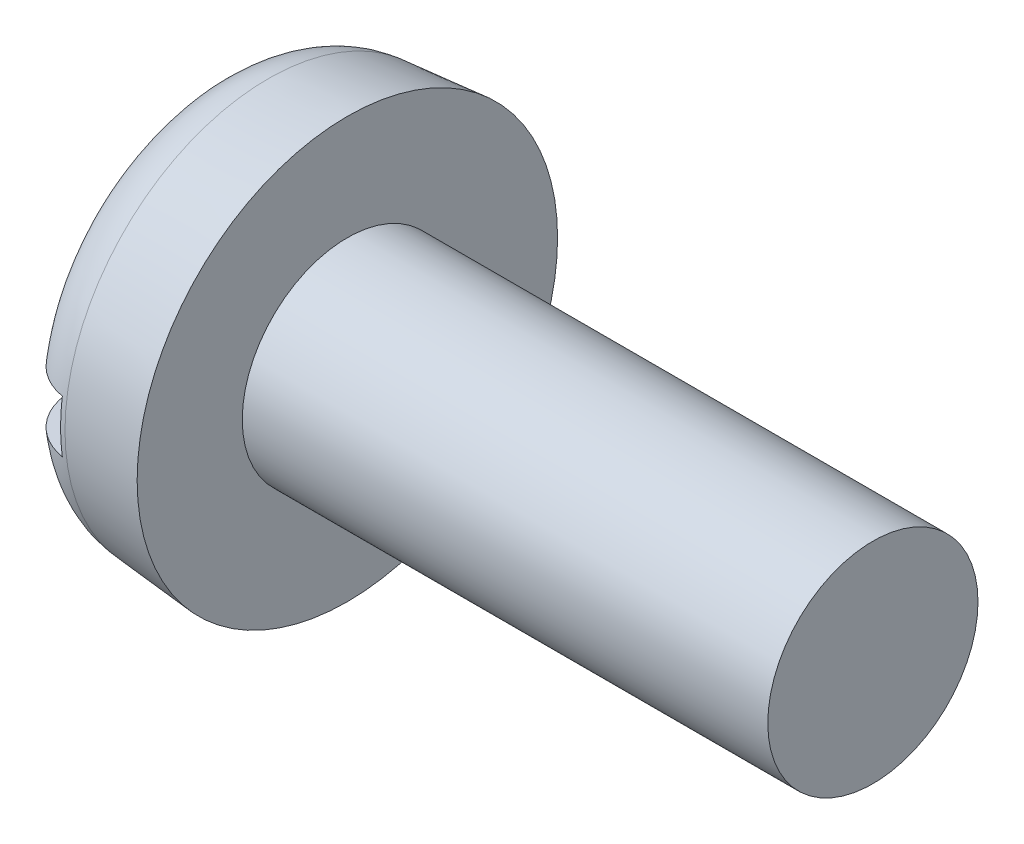
ISO-10303-21;
HEADER;
FILE_DESCRIPTION(('STEP AP214'),'2;1');
FILE_NAME('part.step','',(''),(''),'','','');
FILE_SCHEMA(('AUTOMOTIVE_DESIGN { 1 0 10303 214 1 1 1 1 }'));
ENDSEC;
DATA;
#1=APPLICATION_CONTEXT('core data for automotive mechanical design processes');
#2=APPLICATION_PROTOCOL_DEFINITION('international standard','automotive_design',2000,#1);
#3=PRODUCT_CONTEXT('',#1,'mechanical');
#4=PRODUCT('Part','Part','',(#3));
#5=PRODUCT_RELATED_PRODUCT_CATEGORY('part','',(#4));
#6=PRODUCT_DEFINITION_FORMATION('','',#4);
#7=PRODUCT_DEFINITION_CONTEXT('part definition',#1,'design');
#8=PRODUCT_DEFINITION('design','',#6,#7);
#9=PRODUCT_DEFINITION_SHAPE('','',#8);
#10=(LENGTH_UNIT() NAMED_UNIT(*) SI_UNIT(.MILLI.,.METRE.));
#11=(NAMED_UNIT(*) PLANE_ANGLE_UNIT() SI_UNIT($,.RADIAN.));
#12=(NAMED_UNIT(*) SI_UNIT($,.STERADIAN.) SOLID_ANGLE_UNIT());
#13=UNCERTAINTY_MEASURE_WITH_UNIT(LENGTH_MEASURE(1.E-05),#10,'distance_accuracy_value','');
#14=(GEOMETRIC_REPRESENTATION_CONTEXT(3) GLOBAL_UNCERTAINTY_ASSIGNED_CONTEXT((#13)) GLOBAL_UNIT_ASSIGNED_CONTEXT((#10,
#11,#12)) REPRESENTATION_CONTEXT('',''));
#15=CARTESIAN_POINT('',(0.,0.,0.));
#16=DIRECTION('',(0.,0.,1.));
#17=DIRECTION('',(1.,0.,0.));
#18=AXIS2_PLACEMENT_3D('',#15,#16,#17);
#19=CARTESIAN_POINT('',(0.,0.,0.));
#20=DIRECTION('',(-1.,0.,0.));
#21=DIRECTION('',(0.,0.,1.));
#22=AXIS2_PLACEMENT_3D('',#19,#20,#21);
#23=PLANE('',#22);
#24=DIRECTION('',(0.,0.,-1.));
#25=VECTOR('',#24,1.);
#26=CARTESIAN_POINT('',(0.,0.249999999999998,2.));
#27=LINE('',#26,#25);
#28=CARTESIAN_POINT('',(0.,0.249999999999998,1.3128752634498));
#29=VERTEX_POINT('',#28);
#30=CARTESIAN_POINT('',(0.,0.249999999999998,-1.3128752634498));
#31=VERTEX_POINT('',#30);
#32=EDGE_CURVE('E85',#29,#31,#27,.T.);
#33=ORIENTED_EDGE('',*,*,#32,.F.);
#34=CARTESIAN_POINT('',(0.,0.,0.));
#35=DIRECTION('',(-1.,0.,0.));
#36=DIRECTION('',(0.,0.,1.));
#37=AXIS2_PLACEMENT_3D('',#34,#35,#36);
#38=CIRCLE('',#37,1.33646603300584);
#39=EDGE_CURVE('E91',#29,#31,#38,.T.);
#40=ORIENTED_EDGE('',*,*,#39,.T.);
#41=EDGE_LOOP('',(#33,#40));
#42=FACE_BOUND('',#41,.T.);
#43=ADVANCED_FACE('F32',(#42),#23,.T.);
#44=CARTESIAN_POINT('',(-25.4,0.,0.));
#45=DIRECTION('',(-1.,0.,0.));
#46=DIRECTION('',(0.,0.,1.));
#47=AXIS2_PLACEMENT_3D('',#44,#45,#46);
#48=CYLINDRICAL_SURFACE('',#47,1.);
#49=CARTESIAN_POINT('',(6.3,0.,0.));
#50=DIRECTION('',(-1.,0.,0.));
#51=DIRECTION('',(0.,0.,1.));
#52=AXIS2_PLACEMENT_3D('',#49,#50,#51);
#53=CIRCLE('',#52,1.);
#54=CARTESIAN_POINT('',(6.3,0.,1.));
#55=VERTEX_POINT('',#54);
#56=EDGE_CURVE('E92',#55,#55,#53,.T.);
#57=ORIENTED_EDGE('',*,*,#56,.T.);
#58=EDGE_LOOP('',(#57));
#59=FACE_BOUND('',#58,.T.);
#60=CARTESIAN_POINT('',(1.3,0.,0.));
#61=DIRECTION('',(-1.,0.,0.));
#62=DIRECTION('',(0.,0.,1.));
#63=AXIS2_PLACEMENT_3D('',#60,#61,#62);
#64=CIRCLE('',#63,1.);
#65=CARTESIAN_POINT('',(1.3,0.,1.));
#66=VERTEX_POINT('',#65);
#67=EDGE_CURVE('E149',#66,#66,#64,.T.);
#68=ORIENTED_EDGE('',*,*,#67,.F.);
#69=EDGE_LOOP('',(#68));
#70=FACE_BOUND('',#69,.T.);
#71=ADVANCED_FACE('F137',(#59,#70),#48,.T.);
#72=CARTESIAN_POINT('',(6.3,1.,0.));
#73=DIRECTION('',(1.,0.,0.));
#74=DIRECTION('',(0.,0.,-1.));
#75=AXIS2_PLACEMENT_3D('',#72,#73,#74);
#76=PLANE('',#75);
#77=ORIENTED_EDGE('',*,*,#56,.F.);
#78=EDGE_LOOP('',(#77));
#79=FACE_BOUND('',#78,.T.);
#80=ADVANCED_FACE('F135',(#79),#76,.T.);
#81=DIRECTION('',(0.,0.,1.));
#82=VECTOR('',#81,1.);
#83=CARTESIAN_POINT('',(0.,-0.25,-2.));
#84=LINE('',#83,#82);
#85=CARTESIAN_POINT('',(0.,-0.25,-1.3128752634498));
#86=VERTEX_POINT('',#85);
#87=CARTESIAN_POINT('',(0.,-0.25,1.3128752634498));
#88=VERTEX_POINT('',#87);
#89=EDGE_CURVE('E76',#86,#88,#84,.T.);
#90=ORIENTED_EDGE('',*,*,#89,.F.);
#91=EDGE_CURVE('E83',#86,#88,#38,.T.);
#92=ORIENTED_EDGE('',*,*,#91,.T.);
#93=EDGE_LOOP('',(#90,#92));
#94=FACE_BOUND('',#93,.T.);
#95=ADVANCED_FACE('F82',(#94),#23,.T.);
#96=CARTESIAN_POINT('',(0.,0.,0.));
#97=DIRECTION('',(1.,0.,0.));
#98=DIRECTION('',(0.,0.,-1.));
#99=AXIS2_PLACEMENT_3D('',#96,#97,#98);
#100=CONICAL_SURFACE('',#99,1.8862647374163,0.0872664625997168);
#101=CARTESIAN_POINT('',(0.547706554351407,0.,0.));
#102=DIRECTION('',(-1.,0.,0.));
#103=DIRECTION('',(0.,0.,1.));
#104=AXIS2_PLACEMENT_3D('',#101,#102,#103);
#105=CIRCLE('',#104,1.93418285186089);
#106=CARTESIAN_POINT('',(0.547706554351407,0.,1.93418285186089));
#107=VERTEX_POINT('',#106);
#108=EDGE_CURVE('E95',#107,#107,#105,.F.);
#109=ORIENTED_EDGE('',*,*,#108,.T.);
#110=EDGE_LOOP('',(#109));
#111=FACE_BOUND('',#110,.T.);
#112=CARTESIAN_POINT('',(1.3,0.,0.));
#113=DIRECTION('',(-1.,0.,0.));
#114=DIRECTION('',(0.,0.,1.));
#115=AXIS2_PLACEMENT_3D('',#112,#113,#114);
#116=CIRCLE('',#115,2.);
#117=CARTESIAN_POINT('',(1.3,0.,2.));
#118=VERTEX_POINT('',#117);
#119=EDGE_CURVE('E97',#118,#118,#116,.T.);
#120=ORIENTED_EDGE('',*,*,#119,.T.);
#121=EDGE_LOOP('',(#120));
#122=FACE_BOUND('',#121,.T.);
#123=ADVANCED_FACE('F128',(#111,#122),#100,.T.);
#124=CARTESIAN_POINT('',(1.3,1.,0.));
#125=DIRECTION('',(-1.,0.,0.));
#126=DIRECTION('',(0.,0.,1.));
#127=AXIS2_PLACEMENT_3D('',#124,#125,#126);
#128=PLANE('',#127);
#129=ORIENTED_EDGE('',*,*,#119,.F.);
#130=EDGE_LOOP('',(#129));
#131=FACE_BOUND('',#130,.T.);
#132=ORIENTED_EDGE('',*,*,#67,.T.);
#133=EDGE_LOOP('',(#132));
#134=FACE_BOUND('',#133,.T.);
#135=ADVANCED_FACE('F124',(#131,#134),#128,.F.);
#136=CARTESIAN_POINT('',(0.6,0.,0.));
#137=DIRECTION('',(-1.,0.,0.));
#138=DIRECTION('',(0.,0.,1.));
#139=AXIS2_PLACEMENT_3D('',#136,#137,#138);
#140=TOROIDAL_SURFACE('',#139,1.33646603300584,0.6);
#141=CARTESIAN_POINT('',(0.189533827817901,0.249999999999998,-1.75639022379603));
#142=CARTESIAN_POINT('',(0.21391286216601,0.249999999999998,-1.77948467879215));
#143=CARTESIAN_POINT('',(0.24024869251996,0.249999999999998,-1.80054732602975));
#144=CARTESIAN_POINT('',(0.29610074391237,0.249999999999998,-1.83797474829039));
#145=CARTESIAN_POINT('',(0.325620462292747,0.249999999999998,-1.8543342833978));
#146=CARTESIAN_POINT('',(0.386987812296968,0.249999999999998,-1.88185217452822));
#147=CARTESIAN_POINT('',(0.418834909980418,0.249999999999998,-1.89301171921107));
#148=CARTESIAN_POINT('',(0.483946745898609,0.249999999999998,-1.90980045672232));
#149=CARTESIAN_POINT('',(0.517211148144342,0.249999999999998,-1.91543095275046));
#150=CARTESIAN_POINT('',(0.584095524353838,0.249999999999998,-1.9209904940799));
#151=CARTESIAN_POINT('',(0.617713844349067,0.249999999999998,-1.92093944452031));
#152=CARTESIAN_POINT('',(0.68446419730632,0.249999999999998,-1.91518683561912));
#153=CARTESIAN_POINT('',(0.717596219865291,0.249999999999998,-1.9094851555754));
#154=CARTESIAN_POINT('',(0.782394728177749,0.249999999999998,-1.89260855523632));
#155=CARTESIAN_POINT('',(0.814062838786521,0.249999999999998,-1.88143987080057));
#156=CARTESIAN_POINT('',(0.875081719042154,0.249999999999998,-1.85395886056325));
#157=CARTESIAN_POINT('',(0.904432479739422,0.249999999999998,-1.83764651489811));
#158=CARTESIAN_POINT('',(0.960077668170309,0.249999999999998,-1.80029907430071));
#159=CARTESIAN_POINT('',(0.9863631939778,0.249999999999998,-1.77925071957873));
#160=CARTESIAN_POINT('',(1.03505687827878,0.249999999999998,-1.7330674010218));
#161=CARTESIAN_POINT('',(1.05746494761213,0.249999999999998,-1.70793234324094));
#162=CARTESIAN_POINT('',(1.0979409615539,0.249999999999998,-1.65410838092135));
#163=CARTESIAN_POINT('',(1.11597775303151,0.249999999999998,-1.62539605538755));
#164=CARTESIAN_POINT('',(1.14703544330799,0.249999999999998,-1.5653772191606));
#165=CARTESIAN_POINT('',(1.16005610755277,0.249999999999998,-1.53407058724083));
#166=CARTESIAN_POINT('',(1.18087595689125,0.249999999999998,-1.46937944263898));
#167=CARTESIAN_POINT('',(1.18861493327469,0.249999999999998,-1.43597556112735));
#168=CARTESIAN_POINT('',(1.19846481064019,0.249999999999998,-1.36834921922207));
#169=CARTESIAN_POINT('',(1.20057530995114,0.249999999999998,-1.33412670058295));
#170=CARTESIAN_POINT('',(1.19914590702781,0.249999999999998,-1.26528435330154));
#171=CARTESIAN_POINT('',(1.19552039050567,0.249999999999998,-1.23066630746069));
#172=CARTESIAN_POINT('',(1.18260355578657,0.249999999999998,-1.16250404029349));
#173=CARTESIAN_POINT('',(1.17331170222089,0.249999999999998,-1.12895992074944));
#174=CARTESIAN_POINT('',(1.14915573466833,0.249999999999998,-1.06333384303725));
#175=CARTESIAN_POINT('',(1.13420536362349,0.249999999999998,-1.03128361697005));
#176=CARTESIAN_POINT('',(1.0991747716444,0.249999999999998,-0.970116514628923));
#177=CARTESIAN_POINT('',(1.07909393133358,0.249999999999998,-0.940999993119051));
#178=CARTESIAN_POINT('',(1.03417877153461,0.249999999999998,-0.886344344337588));
#179=CARTESIAN_POINT('',(1.00931177521377,0.249999999999998,-0.860832030218337));
#180=CARTESIAN_POINT('',(0.955570488268512,0.249999999999998,-0.814438910149995));
#181=CARTESIAN_POINT('',(0.92669634225853,0.249999999999998,-0.793557937130591));
#182=CARTESIAN_POINT('',(0.866335805754991,0.249999999999998,-0.757555528040479));
#183=CARTESIAN_POINT('',(0.83491365092188,0.249999999999998,-0.742326677823585));
#184=CARTESIAN_POINT('',(0.769865902721808,0.249999999999998,-0.717693489873345));
#185=CARTESIAN_POINT('',(0.736241371619699,0.249999999999998,-0.708286366711637));
#186=CARTESIAN_POINT('',(0.669621905407705,0.249999999999998,-0.696081257465448));
#187=CARTESIAN_POINT('',(0.636685211338539,0.249999999999998,-0.692964916694868));
#188=CARTESIAN_POINT('',(0.570777199013914,0.249999999999998,-0.692530383395183));
#189=CARTESIAN_POINT('',(0.537805889450138,0.249999999999998,-0.695210977210711));
#190=CARTESIAN_POINT('',(0.473961957121503,0.249999999999998,-0.706041612382887));
#191=CARTESIAN_POINT('',(0.443056210602368,0.249999999999998,-0.713998628670388));
#192=CARTESIAN_POINT('',(0.382959959875471,0.249999999999998,-0.734849180251284));
#193=CARTESIAN_POINT('',(0.353769727200809,0.249999999999998,-0.747743494610361));
#194=CARTESIAN_POINT('',(0.297037609586116,0.249999999999998,-0.778418213510759));
#195=CARTESIAN_POINT('',(0.269563513959213,0.249999999999998,-0.796323727261397));
#196=CARTESIAN_POINT('',(0.217810745198938,0.249999999999998,-0.836272273872065));
#197=CARTESIAN_POINT('',(0.193532799616091,0.249999999999998,-0.858316246022494));
#198=CARTESIAN_POINT('',(0.147530412376912,0.249999999999998,-0.907188078087667));
#199=CARTESIAN_POINT('',(0.126009128611306,0.249999999999998,-0.934207383566724));
#200=CARTESIAN_POINT('',(0.0876544687450438,0.249999999999998,-0.991391836924276));
#201=CARTESIAN_POINT('',(0.0708218617658925,0.249999999999998,-1.02155749981101));
#202=CARTESIAN_POINT('',(0.0418808253678316,0.249999999999998,-1.08512670907524));
#203=CARTESIAN_POINT('',(0.029921236961456,0.249999999999998,-1.11859817427757));
#204=CARTESIAN_POINT('',(0.0117986005132936,0.249999999999998,-1.18707549374775));
#205=CARTESIAN_POINT('',(0.00563542581628784,0.249999999999998,-1.22208131447149));
#206=CARTESIAN_POINT('',(-0.000670915521616435,0.249999999999998,-1.29258202718903));
#207=CARTESIAN_POINT('',(-0.000822867925892758,0.249999999999998,-1.32807612956577));
#208=CARTESIAN_POINT('',(0.00492933169869275,0.249999999999998,-1.39858127024229));
#209=CARTESIAN_POINT('',(0.010834594891854,0.249999999999998,-1.43359221871579));
#210=CARTESIAN_POINT('',(0.0284478524134791,0.249999999999998,-1.50158169418841));
#211=CARTESIAN_POINT('',(0.0400710654600525,0.249999999999998,-1.53458222774722));
#212=CARTESIAN_POINT('',(0.0687763050013223,0.249999999999998,-1.59808423526354));
#213=CARTESIAN_POINT('',(0.0858511560753667,0.249999999999998,-1.62858892830324));
#214=CARTESIAN_POINT('',(0.117592784869628,0.249999999999998,-1.67533700305305));
#215=CARTESIAN_POINT('',(0.130746983226289,0.249999999999998,-1.69262664248886));
#216=CARTESIAN_POINT('',(0.158839636105005,0.249999999999998,-1.72569046888459));
#217=CARTESIAN_POINT('',(0.173778073039715,0.249999999999998,-1.7414646707795));
#218=CARTESIAN_POINT('',(0.189533827817901,0.249999999999998,-1.75639022379603));
#219=B_SPLINE_CURVE_WITH_KNOTS('',3,(#141,#142,#143,#144,#145,#146,#147,#148,#149,#150,#151,
#152,#153,#154,#155,#156,#157,#158,#159,#160,#161,#162,#163,#164,#165,#166,#167,#168,#169,#170,
#171,#172,#173,#174,#175,#176,#177,#178,#179,#180,#181,#182,#183,#184,#185,#186,#187,#188,#189,
#190,#191,#192,#193,#194,#195,#196,#197,#198,#199,#200,#201,#202,#203,#204,#205,#206,#207,#208,
#209,#210,#211,#212,#213,#214,#215,#216,#217,#218),.UNSPECIFIED.,.T.,.F.,(4,2,2,2,2,2,2,2,2,2,2,
2,2,2,2,2,2,2,2,2,2,2,2,2,2,2,2,2,2,2,2,2,2,2,2,2,2,2,4),(0.,0.100664730916281,
0.201441185387835,0.302194592170462,0.40292424561667,0.503301006632521,0.603679911824675,
0.70394458713495,0.804209649647866,0.904759004789331,1.00531067170506,1.10655915996838,
1.20781238203636,1.31020138177896,1.41259768822303,1.51653681009983,1.62048575390889,
1.72608762757818,1.83170225607624,1.9380653163011,2.04442453897639,2.14864413447951,
2.2528138270753,2.35156454182892,2.45029458397876,2.54559856163111,2.64091758368116,
2.738869134693,2.8368429443377,2.94000220563303,3.04317837902267,3.14930468585254,
3.25542867370318,3.36139754921546,3.46738586763706,3.57184799973354,3.6761732021628,
3.74123174488939,3.80628964638302),.UNSPECIFIED.);
#220=CARTESIAN_POINT('',(0.5,0.249999999999998,-1.91179742470572));
#221=VERTEX_POINT('',#220);
#222=EDGE_CURVE('E11',#31,#221,#219,.T.);
#223=ORIENTED_EDGE('',*,*,#222,.F.);
#224=ORIENTED_EDGE('',*,*,#39,.F.);
#225=CARTESIAN_POINT('',(0.288604089174203,0.249999999999998,0.784739016334898));
#226=CARTESIAN_POINT('',(0.316134388457971,0.249999999999998,0.767196914687789));
#227=CARTESIAN_POINT('',(0.345099556161885,0.249999999999998,0.751875311985604));
#228=CARTESIAN_POINT('',(0.405186011024982,0.249999999999998,0.726233960557693));
#229=CARTESIAN_POINT('',(0.436308459251539,0.249999999999998,0.715916929604185));
#230=CARTESIAN_POINT('',(0.499913017867033,0.249999999999998,0.700717140304493));
#231=CARTESIAN_POINT('',(0.532397144208308,0.249999999999998,0.695842757399514));
#232=CARTESIAN_POINT('',(0.597712118075122,0.249999999999998,0.691793299303831));
#233=CARTESIAN_POINT('',(0.630542864477075,0.249999999999998,0.692616605361123));
#234=CARTESIAN_POINT('',(0.694704568383033,0.249999999999998,0.699819560396652));
#235=CARTESIAN_POINT('',(0.726052241959319,0.249999999999998,0.706052028850557));
#236=CARTESIAN_POINT('',(0.787289484038405,0.249999999999998,0.723599538804053));
#237=CARTESIAN_POINT('',(0.817178802983434,0.249999999999998,0.734915446838042));
#238=CARTESIAN_POINT('',(0.875269426551428,0.249999999999998,0.762440714427743));
#239=CARTESIAN_POINT('',(0.903430456569145,0.249999999999998,0.778734824104322));
#240=CARTESIAN_POINT('',(0.956804116043069,0.249999999999998,0.815589498272454));
#241=CARTESIAN_POINT('',(0.982016103087479,0.249999999999998,0.836150989662956));
#242=CARTESIAN_POINT('',(1.0301770633816,0.249999999999998,0.882141005760743));
#243=CARTESIAN_POINT('',(1.05293473503663,0.249999999999998,0.90777002039607));
#244=CARTESIAN_POINT('',(1.09399932055649,0.249999999999998,0.962376268444088));
#245=CARTESIAN_POINT('',(1.11230542100145,0.249999999999998,0.991354112351559));
#246=CARTESIAN_POINT('',(1.14454179886565,0.249999999999998,1.05292268816098));
#247=CARTESIAN_POINT('',(1.1583014153342,0.249999999999998,1.0856029700183));
#248=CARTESIAN_POINT('',(1.18015684562069,0.249999999999998,1.15280722636384));
#249=CARTESIAN_POINT('',(1.18825243720312,0.249999999999998,1.18733127313742));
#250=CARTESIAN_POINT('',(1.19852509118479,0.249999999999998,1.25734425726337));
#251=CARTESIAN_POINT('',(1.20068664617312,0.249999999999998,1.29283547844414));
#252=CARTESIAN_POINT('',(1.19893284924428,0.249999999999998,1.36366876527333));
#253=CARTESIAN_POINT('',(1.19501786044981,0.249999999999998,1.39901083970791));
#254=CARTESIAN_POINT('',(1.18127073741266,0.249999999999998,1.46802046326244));
#255=CARTESIAN_POINT('',(1.17152068295649,0.249999999999998,1.50170435277859));
#256=CARTESIAN_POINT('',(1.14641062930972,0.249999999999998,1.56691275558684));
#257=CARTESIAN_POINT('',(1.13105111093402,0.249999999999998,1.59843745367896));
#258=CARTESIAN_POINT('',(1.09543149628465,0.249999999999998,1.65788896257222));
#259=CARTESIAN_POINT('',(1.07525501841527,0.249999999999998,1.68586588029872));
#260=CARTESIAN_POINT('',(1.03043421840679,0.249999999999998,1.7379775228163));
#261=CARTESIAN_POINT('',(1.00579022553272,0.249999999999998,1.76211253051798));
#262=CARTESIAN_POINT('',(0.953084078701208,0.249999999999998,1.80552791413681));
#263=CARTESIAN_POINT('',(0.925070615500831,0.249999999999998,1.82486741497749));
#264=CARTESIAN_POINT('',(0.866172088939885,0.249999999999998,1.85852096627687));
#265=CARTESIAN_POINT('',(0.835287172622649,0.249999999999998,1.87283527389001));
#266=CARTESIAN_POINT('',(0.771809247980058,0.249999999999998,1.89591076867881));
#267=CARTESIAN_POINT('',(0.739233180536587,0.249999999999998,1.90471857587887));
#268=CARTESIAN_POINT('',(0.673062365450502,0.249999999999998,1.91671385367368));
#269=CARTESIAN_POINT('',(0.639467647775881,0.249999999999998,1.91990148944717));
#270=CARTESIAN_POINT('',(0.572367006328868,0.249999999999998,1.92056082820682));
#271=CARTESIAN_POINT('',(0.538861320147248,0.249999999999998,1.91805700061079));
#272=CARTESIAN_POINT('',(0.47274681744156,0.249999999999998,1.90745770821608));
#273=CARTESIAN_POINT('',(0.440137992786985,0.249999999999998,1.89936229412536));
#274=CARTESIAN_POINT('',(0.376749063680584,0.249999999999998,1.87782031727239));
#275=CARTESIAN_POINT('',(0.345968470291791,0.249999999999998,1.86437519269455));
#276=CARTESIAN_POINT('',(0.287090397079649,0.249999999999998,1.83252636227956));
#277=CARTESIAN_POINT('',(0.258992940590245,0.249999999999998,1.81412261332498));
#278=CARTESIAN_POINT('',(0.206161899889049,0.249999999999998,1.77281309783707));
#279=CARTESIAN_POINT('',(0.181441147897996,0.249999999999998,1.74989092427143));
#280=CARTESIAN_POINT('',(0.136163127640451,0.249999999999998,1.70025036654744));
#281=CARTESIAN_POINT('',(0.115605984783507,0.249999999999998,1.67353186808351));
#282=CARTESIAN_POINT('',(0.0790587737372173,0.249999999999998,1.61683810625696));
#283=CARTESIAN_POINT('',(0.0631057934141207,0.249999999999998,1.58683894142185));
#284=CARTESIAN_POINT('',(0.0363951291287292,0.249999999999998,1.52461181161474));
#285=CARTESIAN_POINT('',(0.0256377279026837,0.249999999999998,1.49238372545698));
#286=CARTESIAN_POINT('',(0.00947640685416026,0.249999999999998,1.42619753260598));
#287=CARTESIAN_POINT('',(0.00413912422282116,0.249999999999998,1.39222316301904));
#288=CARTESIAN_POINT('',(-0.000849634538205287,0.249999999999998,1.32386185092337));
#289=CARTESIAN_POINT('',(-0.000500896508831784,0.249999999999998,1.28947489292359));
#290=CARTESIAN_POINT('',(0.0058758547136506,0.249999999999998,1.22069241104712));
#291=CARTESIAN_POINT('',(0.0119921296161318,0.249999999999998,1.18630507505805));
#292=CARTESIAN_POINT('',(0.0298241103495643,0.249999999999998,1.11900455274082));
#293=CARTESIAN_POINT('',(0.0415416754422541,0.249999999999998,1.08609185986808));
#294=CARTESIAN_POINT('',(0.0704549929801754,0.249999999999998,1.02214969893802));
#295=CARTESIAN_POINT('',(0.0877332276973655,0.249999999999998,0.991157547202658));
#296=CARTESIAN_POINT('',(0.127221040554368,0.249999999999998,0.932521126786533));
#297=CARTESIAN_POINT('',(0.149425793456868,0.249999999999998,0.904873622883556));
#298=CARTESIAN_POINT('',(0.190938555395152,0.249999999999998,0.861314040022332));
#299=CARTESIAN_POINT('',(0.209157594689925,0.249999999999998,0.844351052347313));
#300=CARTESIAN_POINT('',(0.247508472142762,0.249999999999998,0.812742556461499));
#301=CARTESIAN_POINT('',(0.267640273422716,0.249999999999998,0.798097003584993));
#302=CARTESIAN_POINT('',(0.288604089174203,0.249999999999998,0.784739016334898));
#303=B_SPLINE_CURVE_WITH_KNOTS('',3,(#225,#226,#227,#228,#229,#230,#231,#232,#233,#234,#235,
#236,#237,#238,#239,#240,#241,#242,#243,#244,#245,#246,#247,#248,#249,#250,#251,#252,#253,#254,
#255,#256,#257,#258,#259,#260,#261,#262,#263,#264,#265,#266,#267,#268,#269,#270,#271,#272,#273,
#274,#275,#276,#277,#278,#279,#280,#281,#282,#283,#284,#285,#286,#287,#288,#289,#290,#291,#292,
#293,#294,#295,#296,#297,#298,#299,#300,#301,#302),.UNSPECIFIED.,.T.,.F.,(4,2,2,2,2,2,2,2,2,2,2,
2,2,2,2,2,2,2,2,2,2,2,2,2,2,2,2,2,2,2,2,2,2,2,2,2,2,2,4),(0.,0.0978482535524672,
0.195749585048296,0.29380136566425,0.391825290249414,0.487262796573529,0.582716577563643,
0.679895642124601,0.77709583664887,0.879458297771981,0.981839449194436,1.08771468956162,
1.19359408385085,1.29974991042735,1.40589939357788,1.51058969381323,1.61527102263029,
1.71825267299331,1.82122673648107,1.92285985851661,2.02448777891743,2.12524319524782,
2.22599565029322,2.32631575807894,2.42663495611184,2.52692720312882,2.6272203222596,
2.72788456072493,2.82855183078601,2.93000871197334,3.03147111368232,3.13416636231529,
3.23686547888511,3.34116217015267,3.44549350516041,3.55144984066691,3.65730285269071,
3.73181393153072,3.80632357408619),.UNSPECIFIED.);
#304=CARTESIAN_POINT('',(0.5,0.249999999999998,1.91179742470572));
#305=VERTEX_POINT('',#304);
#306=EDGE_CURVE('E109',#305,#29,#303,.T.);
#307=ORIENTED_EDGE('',*,*,#306,.F.);
#308=CARTESIAN_POINT('',(0.5,0.,0.));
#309=DIRECTION('',(-1.,0.,0.));
#310=DIRECTION('',(0.,0.,1.));
#311=AXIS2_PLACEMENT_3D('',#308,#309,#310);
#312=CIRCLE('',#311,1.92807401131581);
#313=CARTESIAN_POINT('',(0.5,-0.25,1.91179742470572));
#314=VERTEX_POINT('',#313);
#315=EDGE_CURVE('E103',#305,#314,#312,.F.);
#316=ORIENTED_EDGE('',*,*,#315,.T.);
#317=CARTESIAN_POINT('',(0.288604089174203,-0.25,0.784739016334897));
#318=CARTESIAN_POINT('',(0.259112884370909,-0.25,0.803533450988556));
#319=CARTESIAN_POINT('',(0.231225898454724,-0.25,0.824904856053635));
#320=CARTESIAN_POINT('',(0.179420071654655,-0.25,0.87206288075389));
#321=CARTESIAN_POINT('',(0.155508499686268,-0.25,0.897857416808734));
#322=CARTESIAN_POINT('',(0.112340043931651,-0.25,0.953020871097778));
#323=CARTESIAN_POINT('',(0.0930758293141024,-0.25,0.982384048576831));
#324=CARTESIAN_POINT('',(0.0596751161388602,-0.25,1.04387760799463));
#325=CARTESIAN_POINT('',(0.0455365870142384,-0.25,1.07600688787161));
#326=CARTESIAN_POINT('',(0.0226119437209166,-0.25,1.1426440977612));
#327=CARTESIAN_POINT('',(0.0139059243025098,-0.25,1.17717964025791));
#328=CARTESIAN_POINT('',(0.00245830158126969,-0.25,1.24723010379983));
#329=CARTESIAN_POINT('',(-0.000282920324025579,-0.25,1.28274508732485));
#330=CARTESIAN_POINT('',(0.000326978904676154,-0.25,1.35347540033146));
#331=CARTESIAN_POINT('',(0.00363548607635161,-0.25,1.38869108382246));
#332=CARTESIAN_POINT('',(0.0162173169606183,-0.25,1.45804112734748));
#333=CARTESIAN_POINT('',(0.0254901283900699,-0.25,1.49217557998588));
#334=CARTESIAN_POINT('',(0.0495772225171149,-0.25,1.55780848471405));
#335=CARTESIAN_POINT('',(0.0643001953281719,-0.25,1.58934044636737));
#336=CARTESIAN_POINT('',(0.0989096497491142,-0.25,1.64943105983788));
#337=CARTESIAN_POINT('',(0.118795692768763,-0.25,1.67798996392052));
#338=CARTESIAN_POINT('',(0.162837404085459,-0.25,1.73086854568014));
#339=CARTESIAN_POINT('',(0.186923960475927,-0.25,1.75524579767658));
#340=CARTESIAN_POINT('',(0.238887940724712,-0.25,1.79955506100913));
#341=CARTESIAN_POINT('',(0.266765128365121,-0.25,1.81948734913452));
#342=CARTESIAN_POINT('',(0.32518445316871,-0.25,1.85411519160236));
#343=CARTESIAN_POINT('',(0.355693765879882,-0.25,1.86886613843065));
#344=CARTESIAN_POINT('',(0.418767055309767,-0.25,1.89299762786523));
#345=CARTESIAN_POINT('',(0.451330946358749,-0.25,1.90237839422782));
#346=CARTESIAN_POINT('',(0.517357480403314,-0.25,1.91544694524538));
#347=CARTESIAN_POINT('',(0.550812766202489,-0.25,1.91917192408416));
#348=CARTESIAN_POINT('',(0.617872702410234,-0.25,1.9209371349684));
#349=CARTESIAN_POINT('',(0.65147734983796,-0.25,1.91897747995936));
#350=CARTESIAN_POINT('',(0.717795709520632,-0.25,1.90944321159363));
#351=CARTESIAN_POINT('',(0.750511403187723,-0.25,1.90188236922565));
#352=CARTESIAN_POINT('',(0.814211773464019,-0.25,1.88138343728574));
#353=CARTESIAN_POINT('',(0.845196451653629,-0.25,1.8684453526233));
#354=CARTESIAN_POINT('',(0.904609763053002,-0.25,1.83754601650854));
#355=CARTESIAN_POINT('',(0.933034452981679,-0.25,1.81957718511303));
#356=CARTESIAN_POINT('',(0.986484508335932,-0.25,1.77914696795246));
#357=CARTESIAN_POINT('',(1.01150981181586,-0.25,1.75668550033834));
#358=CARTESIAN_POINT('',(1.05760565285496,-0.25,1.70778067353059));
#359=CARTESIAN_POINT('',(1.07865349857053,-0.25,1.68131593135762));
#360=CARTESIAN_POINT('',(1.11605706775023,-0.25,1.62525718662348));
#361=CARTESIAN_POINT('',(1.13241261147641,-0.25,1.59566306425126));
#362=CARTESIAN_POINT('',(1.16014645112768,-0.25,1.53387987005179));
#363=CARTESIAN_POINT('',(1.17147446318557,-0.25,1.50166823426566));
#364=CARTESIAN_POINT('',(1.18864316865611,-0.25,1.43581561192305));
#365=CARTESIAN_POINT('',(1.19448351638352,-0.25,1.40217453546109));
#366=CARTESIAN_POINT('',(1.20060402232703,-0.25,1.33391827134408));
#367=CARTESIAN_POINT('',(1.200805568064,-0.25,1.2992960420342));
#368=CARTESIAN_POINT('',(1.19549103445041,-0.25,1.23049390968614));
#369=CARTESIAN_POINT('',(1.18997445818118,-0.25,1.19631404535192));
#370=CARTESIAN_POINT('',(1.17327911206952,-0.25,1.12877552532621));
#371=CARTESIAN_POINT('',(1.16200971687155,-0.25,1.09543926507239));
#372=CARTESIAN_POINT('',(1.1341003010951,-0.25,1.03109391450078));
#373=CARTESIAN_POINT('',(1.11745967090388,-0.25,1.00008508882971));
#374=CARTESIAN_POINT('',(1.07904082648501,-0.25,0.940910551847016));
#375=CARTESIAN_POINT('',(1.0572048260199,-0.25,0.912782315532943));
#376=CARTESIAN_POINT('',(1.00908218884943,-0.25,0.860622014109091));
#377=CARTESIAN_POINT('',(0.982795234064718,-0.25,0.836590241992157));
#378=CARTESIAN_POINT('',(0.926715285698694,-0.25,0.793608894156468));
#379=CARTESIAN_POINT('',(0.896955569067351,-0.25,0.774616000970294));
#380=CARTESIAN_POINT('',(0.834559558231686,-0.25,0.74216152097532));
#381=CARTESIAN_POINT('',(0.801924451047304,-0.25,0.728697664541176));
#382=CARTESIAN_POINT('',(0.73623179128509,-0.25,0.70836577399905));
#383=CARTESIAN_POINT('',(0.703256226316704,-0.25,0.701233231230133));
#384=CARTESIAN_POINT('',(0.636557314490295,-0.25,0.692922965671201));
#385=CARTESIAN_POINT('',(0.602834045644844,-0.25,0.691744624551743));
#386=CARTESIAN_POINT('',(0.537333649207527,-0.25,0.695311592564638));
#387=CARTESIAN_POINT('',(0.505540606673113,-0.25,0.699776178566524));
#388=CARTESIAN_POINT('',(0.443175430624775,-0.25,0.713946111692623));
#389=CARTESIAN_POINT('',(0.412601908129049,-0.25,0.723645302510235));
#390=CARTESIAN_POINT('',(0.366608339343109,-0.25,0.742482025470653));
#391=CARTESIAN_POINT('',(0.350485967304387,-0.25,0.749957763308139));
#392=CARTESIAN_POINT('',(0.31897254209949,-0.25,0.766313857242488));
#393=CARTESIAN_POINT('',(0.30358143570912,-0.25,0.775194110909255));
#394=CARTESIAN_POINT('',(0.288604089174203,-0.25,0.784739016334897));
#395=B_SPLINE_CURVE_WITH_KNOTS('',3,(#317,#318,#319,#320,#321,#322,#323,#324,#325,#326,#327,
#328,#329,#330,#331,#332,#333,#334,#335,#336,#337,#338,#339,#340,#341,#342,#343,#344,#345,#346,
#347,#348,#349,#350,#351,#352,#353,#354,#355,#356,#357,#358,#359,#360,#361,#362,#363,#364,#365,
#366,#367,#368,#369,#370,#371,#372,#373,#374,#375,#376,#377,#378,#379,#380,#381,#382,#383,#384,
#385,#386,#387,#388,#389,#390,#391,#392,#393,#394),.UNSPECIFIED.,.T.,.F.,(4,2,2,2,2,2,2,2,2,2,2,
2,2,2,2,2,2,2,2,2,2,2,2,2,2,2,2,2,2,2,2,2,2,2,2,2,2,2,4),(0.,0.104845289268817,
0.209880225152682,0.314748377364312,0.41957493999829,0.525912610514205,0.632257080210482,
0.737855348956526,0.843444548918052,0.947339393516291,1.05122541538654,1.15354049001198,
1.25584919166555,1.35702822770577,1.45820304766933,1.5587095845989,1.65921412462183,
1.75947238245713,1.85973054875585,1.96014059694996,2.0605524746306,2.16152097514737,
2.26249334273148,2.36445402067816,2.46642112101811,2.56980908185311,2.67320602810594,
2.778284521801,2.883374945662,2.98969391915164,3.09602049374272,3.2014010022258,
3.30673820950848,3.40743359942962,3.50811853216305,3.60398613404926,3.69974123301838,
3.75299164163642,3.80623816853848),.UNSPECIFIED.);
#396=EDGE_CURVE('E90',#88,#314,#395,.T.);
#397=ORIENTED_EDGE('',*,*,#396,.F.);
#398=ORIENTED_EDGE('',*,*,#91,.F.);
#399=CARTESIAN_POINT('',(0.189533827817901,-0.25,-1.75639022379603));
#400=CARTESIAN_POINT('',(0.16481044882289,-0.25,-1.73296530335109));
#401=CARTESIAN_POINT('',(0.142063371887763,-0.25,-1.70741537534206));
#402=CARTESIAN_POINT('',(0.101180421262586,-0.25,-1.65282552401345));
#403=CARTESIAN_POINT('',(0.0830507458652728,-0.25,-1.62378098577046));
#404=CARTESIAN_POINT('',(0.0519283703374219,-0.25,-1.56309520458309));
#405=CARTESIAN_POINT('',(0.0389304222221669,-0.25,-1.53145665462628));
#406=CARTESIAN_POINT('',(0.0183766203038725,-0.25,-1.4664711798565));
#407=CARTESIAN_POINT('',(0.0108194056022057,-0.25,-1.4331246844913));
#408=CARTESIAN_POINT('',(0.00125621976649499,-0.25,-1.36530138011282));
#409=CARTESIAN_POINT('',(-0.000692756882585135,-0.25,-1.33081654414099));
#410=CARTESIAN_POINT('',(0.00112882930904439,-0.25,-1.26199755908225));
#411=CARTESIAN_POINT('',(0.00490010999371502,-0.25,-1.22766342944999));
#412=CARTESIAN_POINT('',(0.0181234965605665,-0.25,-1.15953018446654));
#413=CARTESIAN_POINT('',(0.027666529979709,-0.25,-1.12574871378756));
#414=CARTESIAN_POINT('',(0.0522129128429994,-0.25,-1.0602300598266));
#415=CARTESIAN_POINT('',(0.0672168382122738,-0.25,-1.02849309258091));
#416=CARTESIAN_POINT('',(0.102497114973261,-0.25,-0.96753497895809));
#417=CARTESIAN_POINT('',(0.122840353513864,-0.25,-0.938352506226965));
#418=CARTESIAN_POINT('',(0.16815654765627,-0.25,-0.883826606687018));
#419=CARTESIAN_POINT('',(0.193129935098409,-0.25,-0.858483538369082));
#420=CARTESIAN_POINT('',(0.246930737846179,-0.25,-0.812542923488528));
#421=CARTESIAN_POINT('',(0.27574057593301,-0.25,-0.791924836338685));
#422=CARTESIAN_POINT('',(0.336524528648951,-0.25,-0.756043351278997));
#423=CARTESIAN_POINT('',(0.368497729347565,-0.25,-0.740778412543732));
#424=CARTESIAN_POINT('',(0.433387810729939,-0.25,-0.716739684886528));
#425=CARTESIAN_POINT('',(0.466219411349971,-0.25,-0.70773619775008));
#426=CARTESIAN_POINT('',(0.53295612620906,-0.25,-0.695713195189501));
#427=CARTESIAN_POINT('',(0.566860761003733,-0.25,-0.692691044537604));
#428=CARTESIAN_POINT('',(0.63289155565065,-0.25,-0.692778275171813));
#429=CARTESIAN_POINT('',(0.665018557735387,-0.25,-0.695577120794326));
#430=CARTESIAN_POINT('',(0.728338071633076,-0.25,-0.706552223713997));
#431=CARTESIAN_POINT('',(0.759530549603552,-0.25,-0.71472867550809));
#432=CARTESIAN_POINT('',(0.820042561617088,-0.25,-0.736074380490138));
#433=CARTESIAN_POINT('',(0.849367448658546,-0.25,-0.749228537118214));
#434=CARTESIAN_POINT('',(0.905539095647581,-0.25,-0.780048583669917));
#435=CARTESIAN_POINT('',(0.932385338624187,-0.25,-0.797715411920639));
#436=CARTESIAN_POINT('',(0.984228891872822,-0.25,-0.837971317501609));
#437=CARTESIAN_POINT('',(1.00907272334481,-0.25,-0.860758039337322));
#438=CARTESIAN_POINT('',(1.05478496517247,-0.25,-0.910020684025987));
#439=CARTESIAN_POINT('',(1.0756525292845,-0.25,-0.936497390123483));
#440=CARTESIAN_POINT('',(1.1137297429544,-0.25,-0.993663029409978));
#441=CARTESIAN_POINT('',(1.13073893301591,-0.25,-1.02448573646893));
#442=CARTESIAN_POINT('',(1.15941197685798,-0.25,-1.0885262347756));
#443=CARTESIAN_POINT('',(1.17107537448153,-0.25,-1.12174423013372));
#444=CARTESIAN_POINT('',(1.18880984958103,-0.25,-1.1900562968235));
#445=CARTESIAN_POINT('',(1.19481455289154,-0.25,-1.22516764834155));
#446=CARTESIAN_POINT('',(1.20077760264291,-0.25,-1.29590155947493));
#447=CARTESIAN_POINT('',(1.2007361712324,-0.25,-1.33152410025992));
#448=CARTESIAN_POINT('',(1.19458938784955,-0.25,-1.40186913283581));
#449=CARTESIAN_POINT('',(1.1885472893511,-0.25,-1.43659713700206));
#450=CARTESIAN_POINT('',(1.17061942328439,-0.25,-1.5045114991265));
#451=CARTESIAN_POINT('',(1.15873414917343,-0.25,-1.53769798700705));
#452=CARTESIAN_POINT('',(1.12966988120094,-0.25,-1.6010066198214));
#453=CARTESIAN_POINT('',(1.11258091711957,-0.25,-1.63117009974292));
#454=CARTESIAN_POINT('',(1.07351154080117,-0.25,-1.6881434904905));
#455=CARTESIAN_POINT('',(1.05153150860045,-0.25,-1.71495366161618));
#456=CARTESIAN_POINT('',(1.00364802347861,-0.25,-1.7640566195131));
#457=CARTESIAN_POINT('',(0.977805224263987,-0.25,-1.78640856703207));
#458=CARTESIAN_POINT('',(0.922701604732177,-0.25,-1.82640375787048));
#459=CARTESIAN_POINT('',(0.893440977663865,-0.25,-1.84404726722665));
#460=CARTESIAN_POINT('',(0.832649577244667,-0.25,-1.87394603187197));
#461=CARTESIAN_POINT('',(0.801144412507963,-0.25,-1.88625337199792));
#462=CARTESIAN_POINT('',(0.736509366564556,-0.25,-1.90536973125745));
#463=CARTESIAN_POINT('',(0.703379610465281,-0.25,-1.91217917307309));
#464=CARTESIAN_POINT('',(0.636638536399667,-0.25,-1.92007590165024));
#465=CARTESIAN_POINT('',(0.603031068893571,-0.25,-1.92119577483433));
#466=CARTESIAN_POINT('',(0.53609729420733,-0.25,-1.91776745034433));
#467=CARTESIAN_POINT('',(0.50277105716713,-0.25,-1.9132178784357));
#468=CARTESIAN_POINT('',(0.437394555194039,-0.25,-1.89859274475643));
#469=CARTESIAN_POINT('',(0.405342999289492,-0.25,-1.88852293496507));
#470=CARTESIAN_POINT('',(0.343409576049121,-0.25,-1.86316176818221));
#471=CARTESIAN_POINT('',(0.313525062355737,-0.25,-1.84787691451122));
#472=CARTESIAN_POINT('',(0.26801612097286,-0.25,-1.81956512535395));
#473=CARTESIAN_POINT('',(0.251434931444335,-0.25,-1.80804500382434));
#474=CARTESIAN_POINT('',(0.219515975429254,-0.25,-1.78339518178987));
#475=CARTESIAN_POINT('',(0.204178205095369,-0.25,-1.7702654862656));
#476=CARTESIAN_POINT('',(0.189533827817901,-0.25,-1.75639022379603));
#477=B_SPLINE_CURVE_WITH_KNOTS('',3,(#399,#400,#401,#402,#403,#404,#405,#406,#407,#408,#409,
#410,#411,#412,#413,#414,#415,#416,#417,#418,#419,#420,#421,#422,#423,#424,#425,#426,#427,#428,
#429,#430,#431,#432,#433,#434,#435,#436,#437,#438,#439,#440,#441,#442,#443,#444,#445,#446,#447,
#448,#449,#450,#451,#452,#453,#454,#455,#456,#457,#458,#459,#460,#461,#462,#463,#464,#465,#466,
#467,#468,#469,#470,#471,#472,#473,#474,#475,#476),.UNSPECIFIED.,.T.,.F.,(4,2,2,2,2,2,2,2,2,2,2,
2,2,2,2,2,2,2,2,2,2,2,2,2,2,2,2,2,2,2,2,2,2,2,2,2,2,2,4),(0.,0.102100336324921,
0.204337015848385,0.306468870047131,0.408575168971325,0.511715534232194,0.614868843808299,
0.719691156821885,0.824524527975002,0.930739666196369,1.03696471577847,1.14271882934083,
1.24844247809663,1.35004766418256,1.45160807558232,1.54788965186921,1.64417471065384,
1.74017006316048,1.83618539240744,1.93687160768039,2.03757922748379,2.14270168947607,
2.24783311990947,2.35418288828398,2.46052874912898,2.56576538274798,2.67099313063948,
2.77449484514581,2.87798852036856,2.98000100625893,3.08200772700703,3.1829950561951,
3.28397462067082,3.38437517777973,3.48480007602825,3.58512053185641,3.68531633947474,
3.74579352878429,3.80627053096106),.UNSPECIFIED.);
#478=CARTESIAN_POINT('',(0.5,-0.25,-1.91179742470572));
#479=VERTEX_POINT('',#478);
#480=EDGE_CURVE('E44',#479,#86,#477,.T.);
#481=ORIENTED_EDGE('',*,*,#480,.F.);
#482=EDGE_CURVE('E56',#479,#221,#312,.F.);
#483=ORIENTED_EDGE('',*,*,#482,.T.);
#484=EDGE_LOOP('',(#223,#224,#307,#316,#397,#398,#481,#483));
#485=FACE_BOUND('',#484,.T.);
#486=ORIENTED_EDGE('',*,*,#108,.F.);
#487=EDGE_LOOP('',(#486));
#488=FACE_BOUND('',#487,.T.);
#489=ADVANCED_FACE('F34',(#485,#488),#140,.T.);
#490=CARTESIAN_POINT('',(0.5,0.249999999999998,2.));
#491=DIRECTION('',(0.,1.,0.));
#492=DIRECTION('',(0.,0.,1.));
#493=AXIS2_PLACEMENT_3D('',#490,#491,#492);
#494=PLANE('',#493);
#495=ORIENTED_EDGE('',*,*,#222,.T.);
#496=DIRECTION('',(0.,0.,-1.));
#497=VECTOR('',#496,1.);
#498=CARTESIAN_POINT('',(0.5,0.249999999999998,2.));
#499=LINE('',#498,#497);
#500=EDGE_CURVE('E84',#305,#221,#499,.T.);
#501=ORIENTED_EDGE('',*,*,#500,.F.);
#502=ORIENTED_EDGE('',*,*,#306,.T.);
#503=ORIENTED_EDGE('',*,*,#32,.T.);
#504=EDGE_LOOP('',(#495,#501,#502,#503));
#505=FACE_BOUND('',#504,.T.);
#506=ADVANCED_FACE('F116',(#505),#494,.F.);
#507=CARTESIAN_POINT('',(0.5,-0.25,-2.));
#508=DIRECTION('',(0.,-1.,0.));
#509=DIRECTION('',(0.,0.,-1.));
#510=AXIS2_PLACEMENT_3D('',#507,#508,#509);
#511=PLANE('',#510);
#512=ORIENTED_EDGE('',*,*,#480,.T.);
#513=ORIENTED_EDGE('',*,*,#89,.T.);
#514=ORIENTED_EDGE('',*,*,#396,.T.);
#515=DIRECTION('',(0.,0.,1.));
#516=VECTOR('',#515,1.);
#517=CARTESIAN_POINT('',(0.5,-0.25,-2.));
#518=LINE('',#517,#516);
#519=EDGE_CURVE('E51',#479,#314,#518,.T.);
#520=ORIENTED_EDGE('',*,*,#519,.F.);
#521=EDGE_LOOP('',(#512,#513,#514,#520));
#522=FACE_BOUND('',#521,.T.);
#523=ADVANCED_FACE('F75',(#522),#511,.F.);
#524=CARTESIAN_POINT('',(0.5,0.249999999999998,-2.));
#525=DIRECTION('',(-1.,0.,0.));
#526=DIRECTION('',(0.,0.,1.));
#527=AXIS2_PLACEMENT_3D('',#524,#525,#526);
#528=PLANE('',#527);
#529=ORIENTED_EDGE('',*,*,#519,.T.);
#530=ORIENTED_EDGE('',*,*,#315,.F.);
#531=ORIENTED_EDGE('',*,*,#500,.T.);
#532=ORIENTED_EDGE('',*,*,#482,.F.);
#533=EDGE_LOOP('',(#529,#530,#531,#532));
#534=FACE_BOUND('',#533,.T.);
#535=ADVANCED_FACE('F115',(#534),#528,.T.);
#536=CLOSED_SHELL('',(#43,#71,#80,#95,#123,#135,#489,#506,#523,#535));
#537=MANIFOLD_SOLID_BREP('B2',#536);
#538=ADVANCED_BREP_SHAPE_REPRESENTATION('',(#18,#537),#14);
#539=SHAPE_DEFINITION_REPRESENTATION(#9,#538);
ENDSEC;
END-ISO-10303-21;
